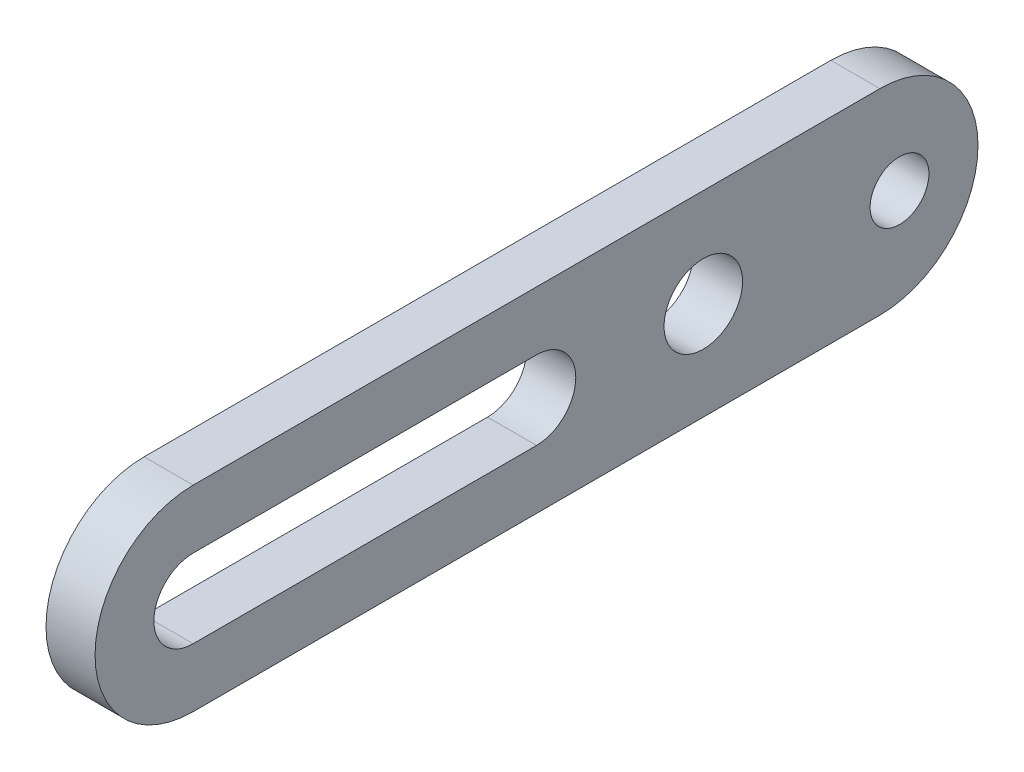
ISO-10303-21;
HEADER;
FILE_DESCRIPTION(('STEP AP214'),'2;1');
FILE_NAME('part.step','',(''),(''),'','','');
FILE_SCHEMA(('AUTOMOTIVE_DESIGN { 1 0 10303 214 1 1 1 1 }'));
ENDSEC;
DATA;
#1=APPLICATION_CONTEXT('core data for automotive mechanical design processes');
#2=APPLICATION_PROTOCOL_DEFINITION('international standard','automotive_design',2000,#1);
#3=PRODUCT_CONTEXT('',#1,'mechanical');
#4=PRODUCT('Part','Part','',(#3));
#5=PRODUCT_RELATED_PRODUCT_CATEGORY('part','',(#4));
#6=PRODUCT_DEFINITION_FORMATION('','',#4);
#7=PRODUCT_DEFINITION_CONTEXT('part definition',#1,'design');
#8=PRODUCT_DEFINITION('design','',#6,#7);
#9=PRODUCT_DEFINITION_SHAPE('','',#8);
#10=(LENGTH_UNIT() NAMED_UNIT(*) SI_UNIT(.MILLI.,.METRE.));
#11=(NAMED_UNIT(*) PLANE_ANGLE_UNIT() SI_UNIT($,.RADIAN.));
#12=(NAMED_UNIT(*) SI_UNIT($,.STERADIAN.) SOLID_ANGLE_UNIT());
#13=UNCERTAINTY_MEASURE_WITH_UNIT(LENGTH_MEASURE(1.E-05),#10,'distance_accuracy_value','');
#14=(GEOMETRIC_REPRESENTATION_CONTEXT(3) GLOBAL_UNCERTAINTY_ASSIGNED_CONTEXT((#13)) GLOBAL_UNIT_ASSIGNED_CONTEXT((#10,
#11,#12)) REPRESENTATION_CONTEXT('',''));
#15=CARTESIAN_POINT('',(0.,0.,0.));
#16=DIRECTION('',(0.,0.,1.));
#17=DIRECTION('',(1.,0.,0.));
#18=AXIS2_PLACEMENT_3D('',#15,#16,#17);
#19=CARTESIAN_POINT('',(5.,0.,35.));
#20=DIRECTION('',(-1.,0.,0.));
#21=DIRECTION('',(0.,0.,1.));
#22=AXIS2_PLACEMENT_3D('',#19,#20,#21);
#23=CYLINDRICAL_SURFACE('',#22,10.);
#24=CARTESIAN_POINT('',(0.,0.,35.));
#25=DIRECTION('',(1.,0.,0.));
#26=DIRECTION('',(0.,0.,-1.));
#27=AXIS2_PLACEMENT_3D('',#24,#25,#26);
#28=CIRCLE('',#27,10.);
#29=CARTESIAN_POINT('',(0.,10.,35.));
#30=VERTEX_POINT('',#29);
#31=CARTESIAN_POINT('',(0.,-10.,35.));
#32=VERTEX_POINT('',#31);
#33=EDGE_CURVE('E142',#30,#32,#28,.T.);
#34=ORIENTED_EDGE('',*,*,#33,.T.);
#35=DIRECTION('',(-1.,0.,0.));
#36=VECTOR('',#35,1.);
#37=CARTESIAN_POINT('',(5.,-10.,35.));
#38=LINE('',#37,#36);
#39=CARTESIAN_POINT('',(5.,-10.,35.));
#40=VERTEX_POINT('',#39);
#41=EDGE_CURVE('E11',#40,#32,#38,.T.);
#42=ORIENTED_EDGE('',*,*,#41,.F.);
#43=CARTESIAN_POINT('',(5.,0.,35.));
#44=DIRECTION('',(1.,0.,0.));
#45=DIRECTION('',(0.,0.,-1.));
#46=AXIS2_PLACEMENT_3D('',#43,#44,#45);
#47=CIRCLE('',#46,10.);
#48=CARTESIAN_POINT('',(5.,10.,35.));
#49=VERTEX_POINT('',#48);
#50=EDGE_CURVE('E145',#49,#40,#47,.T.);
#51=ORIENTED_EDGE('',*,*,#50,.F.);
#52=DIRECTION('',(-1.,0.,0.));
#53=VECTOR('',#52,1.);
#54=CARTESIAN_POINT('',(5.,10.,35.));
#55=LINE('',#54,#53);
#56=EDGE_CURVE('E156',#49,#30,#55,.T.);
#57=ORIENTED_EDGE('',*,*,#56,.T.);
#58=EDGE_LOOP('',(#34,#42,#51,#57));
#59=FACE_BOUND('',#58,.T.);
#60=ADVANCED_FACE('F32',(#59),#23,.T.);
#61=CARTESIAN_POINT('',(5.,-10.,35.));
#62=DIRECTION('',(0.,1.,0.));
#63=DIRECTION('',(0.,0.,1.));
#64=AXIS2_PLACEMENT_3D('',#61,#62,#63);
#65=PLANE('',#64);
#66=DIRECTION('',(0.,0.,-1.));
#67=VECTOR('',#66,1.);
#68=CARTESIAN_POINT('',(0.,-10.,35.));
#69=LINE('',#68,#67);
#70=CARTESIAN_POINT('',(0.,-9.99999999999999,-35.));
#71=VERTEX_POINT('',#70);
#72=EDGE_CURVE('E159',#32,#71,#69,.T.);
#73=ORIENTED_EDGE('',*,*,#72,.T.);
#74=DIRECTION('',(-1.,0.,0.));
#75=VECTOR('',#74,1.);
#76=CARTESIAN_POINT('',(5.,-9.99999999999999,-35.));
#77=LINE('',#76,#75);
#78=CARTESIAN_POINT('',(5.,-9.99999999999999,-35.));
#79=VERTEX_POINT('',#78);
#80=EDGE_CURVE('E39',#79,#71,#77,.T.);
#81=ORIENTED_EDGE('',*,*,#80,.F.);
#82=DIRECTION('',(0.,0.,-1.));
#83=VECTOR('',#82,1.);
#84=CARTESIAN_POINT('',(5.,-10.,35.));
#85=LINE('',#84,#83);
#86=EDGE_CURVE('E148',#40,#79,#85,.T.);
#87=ORIENTED_EDGE('',*,*,#86,.F.);
#88=ORIENTED_EDGE('',*,*,#41,.T.);
#89=EDGE_LOOP('',(#73,#81,#87,#88));
#90=FACE_BOUND('',#89,.T.);
#91=ADVANCED_FACE('F186',(#90),#65,.F.);
#92=CARTESIAN_POINT('',(5.,0.,-35.));
#93=DIRECTION('',(-1.,0.,0.));
#94=DIRECTION('',(0.,0.,1.));
#95=AXIS2_PLACEMENT_3D('',#92,#93,#94);
#96=CYLINDRICAL_SURFACE('',#95,10.);
#97=CARTESIAN_POINT('',(0.,0.,-35.));
#98=DIRECTION('',(1.,0.,0.));
#99=DIRECTION('',(0.,0.,-1.));
#100=AXIS2_PLACEMENT_3D('',#97,#98,#99);
#101=CIRCLE('',#100,10.);
#102=CARTESIAN_POINT('',(0.,10.,-35.));
#103=VERTEX_POINT('',#102);
#104=EDGE_CURVE('E161',#71,#103,#101,.T.);
#105=ORIENTED_EDGE('',*,*,#104,.T.);
#106=DIRECTION('',(-1.,0.,0.));
#107=VECTOR('',#106,1.);
#108=CARTESIAN_POINT('',(5.,10.,-35.));
#109=LINE('',#108,#107);
#110=CARTESIAN_POINT('',(5.,10.,-35.));
#111=VERTEX_POINT('',#110);
#112=EDGE_CURVE('E167',#111,#103,#109,.T.);
#113=ORIENTED_EDGE('',*,*,#112,.F.);
#114=CARTESIAN_POINT('',(5.,0.,-35.));
#115=DIRECTION('',(1.,0.,0.));
#116=DIRECTION('',(0.,0.,-1.));
#117=AXIS2_PLACEMENT_3D('',#114,#115,#116);
#118=CIRCLE('',#117,10.);
#119=EDGE_CURVE('E151',#79,#111,#118,.T.);
#120=ORIENTED_EDGE('',*,*,#119,.F.);
#121=ORIENTED_EDGE('',*,*,#80,.T.);
#122=EDGE_LOOP('',(#105,#113,#120,#121));
#123=FACE_BOUND('',#122,.T.);
#124=ADVANCED_FACE('F173',(#123),#96,.T.);
#125=CARTESIAN_POINT('',(5.,10.,35.));
#126=DIRECTION('',(0.,1.,0.));
#127=DIRECTION('',(0.,0.,1.));
#128=AXIS2_PLACEMENT_3D('',#125,#126,#127);
#129=PLANE('',#128);
#130=DIRECTION('',(0.,0.,-1.));
#131=VECTOR('',#130,1.);
#132=CARTESIAN_POINT('',(0.,10.,35.));
#133=LINE('',#132,#131);
#134=EDGE_CURVE('E149',#30,#103,#133,.T.);
#135=ORIENTED_EDGE('',*,*,#134,.F.);
#136=ORIENTED_EDGE('',*,*,#56,.F.);
#137=DIRECTION('',(0.,0.,-1.));
#138=VECTOR('',#137,1.);
#139=CARTESIAN_POINT('',(5.,10.,35.));
#140=LINE('',#139,#138);
#141=EDGE_CURVE('E153',#49,#111,#140,.T.);
#142=ORIENTED_EDGE('',*,*,#141,.T.);
#143=ORIENTED_EDGE('',*,*,#112,.T.);
#144=EDGE_LOOP('',(#135,#136,#142,#143));
#145=FACE_BOUND('',#144,.T.);
#146=ADVANCED_FACE('F180',(#145),#129,.T.);
#147=CARTESIAN_POINT('',(5.,0.,35.));
#148=DIRECTION('',(1.,0.,0.));
#149=DIRECTION('',(0.,0.,-1.));
#150=AXIS2_PLACEMENT_3D('',#147,#148,#149);
#151=PLANE('',#150);
#152=CARTESIAN_POINT('',(5.,0.,35.));
#153=DIRECTION('',(1.,0.,0.));
#154=DIRECTION('',(0.,0.,-1.));
#155=AXIS2_PLACEMENT_3D('',#152,#153,#154);
#156=CIRCLE('',#155,4.);
#157=CARTESIAN_POINT('',(5.,4.,35.));
#158=VERTEX_POINT('',#157);
#159=CARTESIAN_POINT('',(5.,-4.,35.));
#160=VERTEX_POINT('',#159);
#161=EDGE_CURVE('E46',#158,#160,#156,.T.);
#162=ORIENTED_EDGE('',*,*,#161,.F.);
#163=DIRECTION('',(0.,0.,1.));
#164=VECTOR('',#163,1.);
#165=CARTESIAN_POINT('',(5.,4.,35.));
#166=LINE('',#165,#164);
#167=CARTESIAN_POINT('',(5.,4.,0.));
#168=VERTEX_POINT('',#167);
#169=EDGE_CURVE('E114',#168,#158,#166,.T.);
#170=ORIENTED_EDGE('',*,*,#169,.F.);
#171=CARTESIAN_POINT('',(5.,0.,0.));
#172=DIRECTION('',(1.,0.,0.));
#173=DIRECTION('',(0.,0.,-1.));
#174=AXIS2_PLACEMENT_3D('',#171,#172,#173);
#175=CIRCLE('',#174,4.);
#176=CARTESIAN_POINT('',(5.,-4.,0.));
#177=VERTEX_POINT('',#176);
#178=EDGE_CURVE('E117',#177,#168,#175,.T.);
#179=ORIENTED_EDGE('',*,*,#178,.F.);
#180=DIRECTION('',(0.,0.,-1.));
#181=VECTOR('',#180,1.);
#182=CARTESIAN_POINT('',(5.,-4.,35.));
#183=LINE('',#182,#181);
#184=EDGE_CURVE('E123',#160,#177,#183,.T.);
#185=ORIENTED_EDGE('',*,*,#184,.F.);
#186=EDGE_LOOP('',(#162,#170,#179,#185));
#187=FACE_BOUND('',#186,.T.);
#188=CARTESIAN_POINT('',(5.,0.,-37.));
#189=DIRECTION('',(1.,0.,0.));
#190=DIRECTION('',(0.,0.,-1.));
#191=AXIS2_PLACEMENT_3D('',#188,#189,#190);
#192=CIRCLE('',#191,3.);
#193=CARTESIAN_POINT('',(5.,0.,-40.));
#194=VERTEX_POINT('',#193);
#195=EDGE_CURVE('E129',#194,#194,#192,.T.);
#196=ORIENTED_EDGE('',*,*,#195,.F.);
#197=EDGE_LOOP('',(#196));
#198=FACE_BOUND('',#197,.T.);
#199=CARTESIAN_POINT('',(5.,0.,-17.));
#200=DIRECTION('',(1.,0.,0.));
#201=DIRECTION('',(0.,0.,-1.));
#202=AXIS2_PLACEMENT_3D('',#199,#200,#201);
#203=CIRCLE('',#202,4.);
#204=CARTESIAN_POINT('',(5.,0.,-21.));
#205=VERTEX_POINT('',#204);
#206=EDGE_CURVE('E136',#205,#205,#203,.T.);
#207=ORIENTED_EDGE('',*,*,#206,.F.);
#208=EDGE_LOOP('',(#207));
#209=FACE_BOUND('',#208,.T.);
#210=ORIENTED_EDGE('',*,*,#50,.T.);
#211=ORIENTED_EDGE('',*,*,#86,.T.);
#212=ORIENTED_EDGE('',*,*,#119,.T.);
#213=ORIENTED_EDGE('',*,*,#141,.F.);
#214=EDGE_LOOP('',(#210,#211,#212,#213));
#215=FACE_BOUND('',#214,.T.);
#216=ADVANCED_FACE('F184',(#187,#198,#209,#215),#151,.T.);
#217=CARTESIAN_POINT('',(0.,0.,35.));
#218=DIRECTION('',(1.,0.,0.));
#219=DIRECTION('',(0.,0.,-1.));
#220=AXIS2_PLACEMENT_3D('',#217,#218,#219);
#221=PLANE('',#220);
#222=DIRECTION('',(0.,0.,1.));
#223=VECTOR('',#222,1.);
#224=CARTESIAN_POINT('',(0.,4.,35.));
#225=LINE('',#224,#223);
#226=CARTESIAN_POINT('',(0.,4.,0.));
#227=VERTEX_POINT('',#226);
#228=CARTESIAN_POINT('',(0.,4.,35.));
#229=VERTEX_POINT('',#228);
#230=EDGE_CURVE('E104',#227,#229,#225,.T.);
#231=ORIENTED_EDGE('',*,*,#230,.T.);
#232=CARTESIAN_POINT('',(0.,0.,35.));
#233=DIRECTION('',(1.,0.,0.));
#234=DIRECTION('',(0.,0.,-1.));
#235=AXIS2_PLACEMENT_3D('',#232,#233,#234);
#236=CIRCLE('',#235,4.);
#237=CARTESIAN_POINT('',(0.,-4.,35.));
#238=VERTEX_POINT('',#237);
#239=EDGE_CURVE('E98',#229,#238,#236,.T.);
#240=ORIENTED_EDGE('',*,*,#239,.T.);
#241=DIRECTION('',(0.,0.,-1.));
#242=VECTOR('',#241,1.);
#243=CARTESIAN_POINT('',(0.,-4.,35.));
#244=LINE('',#243,#242);
#245=CARTESIAN_POINT('',(0.,-4.,0.));
#246=VERTEX_POINT('',#245);
#247=EDGE_CURVE('E107',#238,#246,#244,.T.);
#248=ORIENTED_EDGE('',*,*,#247,.T.);
#249=CARTESIAN_POINT('',(0.,0.,0.));
#250=DIRECTION('',(1.,0.,0.));
#251=DIRECTION('',(0.,0.,-1.));
#252=AXIS2_PLACEMENT_3D('',#249,#250,#251);
#253=CIRCLE('',#252,4.);
#254=EDGE_CURVE('E54',#246,#227,#253,.T.);
#255=ORIENTED_EDGE('',*,*,#254,.T.);
#256=EDGE_LOOP('',(#231,#240,#248,#255));
#257=FACE_BOUND('',#256,.T.);
#258=CARTESIAN_POINT('',(0.,0.,-37.));
#259=DIRECTION('',(1.,0.,0.));
#260=DIRECTION('',(0.,0.,-1.));
#261=AXIS2_PLACEMENT_3D('',#258,#259,#260);
#262=CIRCLE('',#261,3.);
#263=CARTESIAN_POINT('',(0.,0.,-40.));
#264=VERTEX_POINT('',#263);
#265=EDGE_CURVE('E133',#264,#264,#262,.T.);
#266=ORIENTED_EDGE('',*,*,#265,.T.);
#267=EDGE_LOOP('',(#266));
#268=FACE_BOUND('',#267,.T.);
#269=CARTESIAN_POINT('',(0.,0.,-17.));
#270=DIRECTION('',(1.,0.,0.));
#271=DIRECTION('',(0.,0.,-1.));
#272=AXIS2_PLACEMENT_3D('',#269,#270,#271);
#273=CIRCLE('',#272,4.);
#274=CARTESIAN_POINT('',(0.,0.,-21.));
#275=VERTEX_POINT('',#274);
#276=EDGE_CURVE('E139',#275,#275,#273,.T.);
#277=ORIENTED_EDGE('',*,*,#276,.T.);
#278=EDGE_LOOP('',(#277));
#279=FACE_BOUND('',#278,.T.);
#280=ORIENTED_EDGE('',*,*,#33,.F.);
#281=ORIENTED_EDGE('',*,*,#134,.T.);
#282=ORIENTED_EDGE('',*,*,#104,.F.);
#283=ORIENTED_EDGE('',*,*,#72,.F.);
#284=EDGE_LOOP('',(#280,#281,#282,#283));
#285=FACE_BOUND('',#284,.T.);
#286=ADVANCED_FACE('F111',(#257,#268,#279,#285),#221,.F.);
#287=CARTESIAN_POINT('',(0.,0.,-17.));
#288=DIRECTION('',(1.,0.,0.));
#289=DIRECTION('',(0.,0.,-1.));
#290=AXIS2_PLACEMENT_3D('',#287,#288,#289);
#291=CYLINDRICAL_SURFACE('',#290,4.);
#292=ORIENTED_EDGE('',*,*,#276,.F.);
#293=EDGE_LOOP('',(#292));
#294=FACE_BOUND('',#293,.T.);
#295=ORIENTED_EDGE('',*,*,#206,.T.);
#296=EDGE_LOOP('',(#295));
#297=FACE_BOUND('',#296,.T.);
#298=ADVANCED_FACE('F201',(#294,#297),#291,.F.);
#299=CARTESIAN_POINT('',(0.,0.,-37.));
#300=DIRECTION('',(1.,0.,0.));
#301=DIRECTION('',(0.,0.,-1.));
#302=AXIS2_PLACEMENT_3D('',#299,#300,#301);
#303=CYLINDRICAL_SURFACE('',#302,3.);
#304=ORIENTED_EDGE('',*,*,#265,.F.);
#305=EDGE_LOOP('',(#304));
#306=FACE_BOUND('',#305,.T.);
#307=ORIENTED_EDGE('',*,*,#195,.T.);
#308=EDGE_LOOP('',(#307));
#309=FACE_BOUND('',#308,.T.);
#310=ADVANCED_FACE('F207',(#306,#309),#303,.F.);
#311=CARTESIAN_POINT('',(0.,0.,35.));
#312=DIRECTION('',(1.,0.,0.));
#313=DIRECTION('',(0.,0.,-1.));
#314=AXIS2_PLACEMENT_3D('',#311,#312,#313);
#315=CYLINDRICAL_SURFACE('',#314,4.);
#316=ORIENTED_EDGE('',*,*,#161,.T.);
#317=DIRECTION('',(1.,0.,0.));
#318=VECTOR('',#317,1.);
#319=CARTESIAN_POINT('',(0.,-4.,35.));
#320=LINE('',#319,#318);
#321=EDGE_CURVE('E94',#238,#160,#320,.T.);
#322=ORIENTED_EDGE('',*,*,#321,.F.);
#323=ORIENTED_EDGE('',*,*,#239,.F.);
#324=DIRECTION('',(1.,0.,0.));
#325=VECTOR('',#324,1.);
#326=CARTESIAN_POINT('',(0.,4.,35.));
#327=LINE('',#326,#325);
#328=EDGE_CURVE('E127',#229,#158,#327,.T.);
#329=ORIENTED_EDGE('',*,*,#328,.T.);
#330=EDGE_LOOP('',(#316,#322,#323,#329));
#331=FACE_BOUND('',#330,.T.);
#332=ADVANCED_FACE('F96',(#331),#315,.F.);
#333=CARTESIAN_POINT('',(0.,4.,35.));
#334=DIRECTION('',(0.,1.,0.));
#335=DIRECTION('',(0.,0.,1.));
#336=AXIS2_PLACEMENT_3D('',#333,#334,#335);
#337=PLANE('',#336);
#338=ORIENTED_EDGE('',*,*,#169,.T.);
#339=ORIENTED_EDGE('',*,*,#328,.F.);
#340=ORIENTED_EDGE('',*,*,#230,.F.);
#341=DIRECTION('',(1.,0.,0.));
#342=VECTOR('',#341,1.);
#343=CARTESIAN_POINT('',(0.,4.,0.));
#344=LINE('',#343,#342);
#345=EDGE_CURVE('E130',#227,#168,#344,.T.);
#346=ORIENTED_EDGE('',*,*,#345,.T.);
#347=EDGE_LOOP('',(#338,#339,#340,#346));
#348=FACE_BOUND('',#347,.T.);
#349=ADVANCED_FACE('F214',(#348),#337,.F.);
#350=CARTESIAN_POINT('',(0.,0.,0.));
#351=DIRECTION('',(1.,0.,0.));
#352=DIRECTION('',(0.,0.,-1.));
#353=AXIS2_PLACEMENT_3D('',#350,#351,#352);
#354=CYLINDRICAL_SURFACE('',#353,4.);
#355=ORIENTED_EDGE('',*,*,#178,.T.);
#356=ORIENTED_EDGE('',*,*,#345,.F.);
#357=ORIENTED_EDGE('',*,*,#254,.F.);
#358=DIRECTION('',(1.,0.,0.));
#359=VECTOR('',#358,1.);
#360=CARTESIAN_POINT('',(0.,-4.,0.));
#361=LINE('',#360,#359);
#362=EDGE_CURVE('E103',#246,#177,#361,.T.);
#363=ORIENTED_EDGE('',*,*,#362,.T.);
#364=EDGE_LOOP('',(#355,#356,#357,#363));
#365=FACE_BOUND('',#364,.T.);
#366=ADVANCED_FACE('F217',(#365),#354,.F.);
#367=CARTESIAN_POINT('',(0.,-4.,35.));
#368=DIRECTION('',(0.,-1.,0.));
#369=DIRECTION('',(0.,0.,-1.));
#370=AXIS2_PLACEMENT_3D('',#367,#368,#369);
#371=PLANE('',#370);
#372=ORIENTED_EDGE('',*,*,#184,.T.);
#373=ORIENTED_EDGE('',*,*,#362,.F.);
#374=ORIENTED_EDGE('',*,*,#247,.F.);
#375=ORIENTED_EDGE('',*,*,#321,.T.);
#376=EDGE_LOOP('',(#372,#373,#374,#375));
#377=FACE_BOUND('',#376,.T.);
#378=ADVANCED_FACE('F108',(#377),#371,.F.);
#379=CLOSED_SHELL('',(#60,#91,#124,#146,#216,#286,#298,#310,#332,#349,#366,#378));
#380=MANIFOLD_SOLID_BREP('B2',#379);
#381=ADVANCED_BREP_SHAPE_REPRESENTATION('',(#18,#380),#14);
#382=SHAPE_DEFINITION_REPRESENTATION(#9,#381);
ENDSEC;
END-ISO-10303-21;
